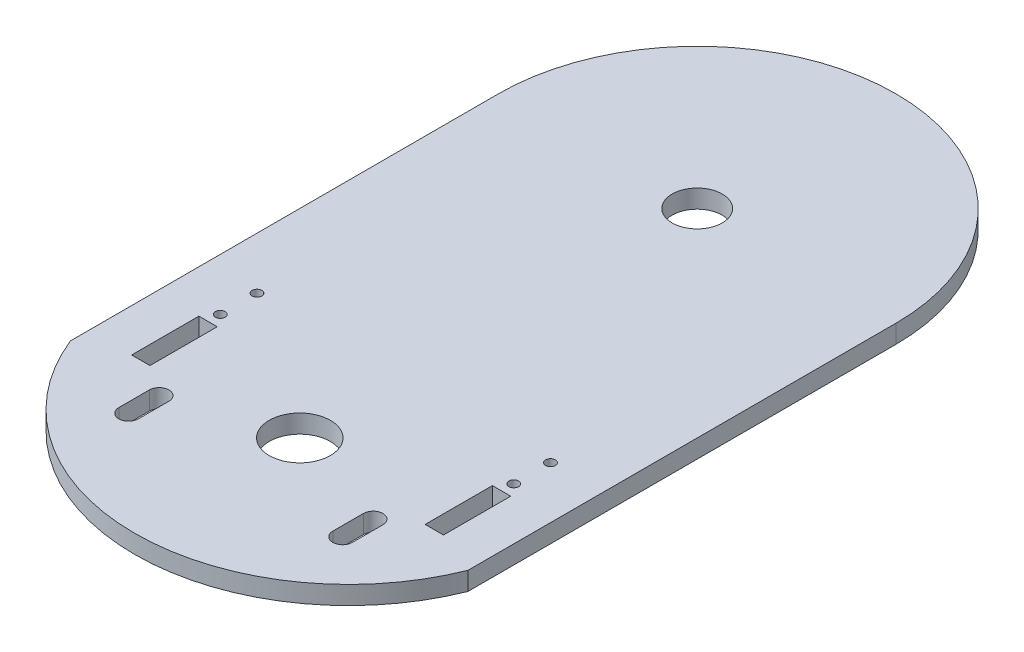
ISO-10303-21;
HEADER;
FILE_DESCRIPTION(('STEP AP214'),'2;1');
FILE_NAME('part.step','',(''),(''),'','','');
FILE_SCHEMA(('AUTOMOTIVE_DESIGN { 1 0 10303 214 1 1 1 1 }'));
ENDSEC;
DATA;
#1=APPLICATION_CONTEXT('core data for automotive mechanical design processes');
#2=APPLICATION_PROTOCOL_DEFINITION('international standard','automotive_design',2000,#1);
#3=PRODUCT_CONTEXT('',#1,'mechanical');
#4=PRODUCT('Part','Part','',(#3));
#5=PRODUCT_RELATED_PRODUCT_CATEGORY('part','',(#4));
#6=PRODUCT_DEFINITION_FORMATION('','',#4);
#7=PRODUCT_DEFINITION_CONTEXT('part definition',#1,'design');
#8=PRODUCT_DEFINITION('design','',#6,#7);
#9=PRODUCT_DEFINITION_SHAPE('','',#8);
#10=(LENGTH_UNIT() NAMED_UNIT(*) SI_UNIT(.MILLI.,.METRE.));
#11=(NAMED_UNIT(*) PLANE_ANGLE_UNIT() SI_UNIT($,.RADIAN.));
#12=(NAMED_UNIT(*) SI_UNIT($,.STERADIAN.) SOLID_ANGLE_UNIT());
#13=UNCERTAINTY_MEASURE_WITH_UNIT(LENGTH_MEASURE(1.E-05),#10,'distance_accuracy_value','');
#14=(GEOMETRIC_REPRESENTATION_CONTEXT(3) GLOBAL_UNCERTAINTY_ASSIGNED_CONTEXT((#13)) GLOBAL_UNIT_ASSIGNED_CONTEXT((#10,
#11,#12)) REPRESENTATION_CONTEXT('',''));
#15=CARTESIAN_POINT('',(0.,0.,0.));
#16=DIRECTION('',(0.,0.,1.));
#17=DIRECTION('',(1.,0.,0.));
#18=AXIS2_PLACEMENT_3D('',#15,#16,#17);
#19=CARTESIAN_POINT('',(-32.5,3.,0.));
#20=DIRECTION('',(-1.,0.,0.));
#21=DIRECTION('',(0.,0.,1.));
#22=AXIS2_PLACEMENT_3D('',#19,#20,#21);
#23=PLANE('',#22);
#24=DIRECTION('',(0.,0.,-1.));
#25=VECTOR('',#24,1.);
#26=CARTESIAN_POINT('',(-32.5,0.,0.));
#27=LINE('',#26,#25);
#28=CARTESIAN_POINT('',(-32.5,0.,35.));
#29=VERTEX_POINT('',#28);
#30=CARTESIAN_POINT('',(-32.5,0.,-35.));
#31=VERTEX_POINT('',#30);
#32=EDGE_CURVE('E340',#29,#31,#27,.T.);
#33=ORIENTED_EDGE('',*,*,#32,.F.);
#34=DIRECTION('',(0.,-1.,0.));
#35=VECTOR('',#34,1.);
#36=CARTESIAN_POINT('',(-32.5,3.,35.));
#37=LINE('',#36,#35);
#38=CARTESIAN_POINT('',(-32.5,3.,35.));
#39=VERTEX_POINT('',#38);
#40=EDGE_CURVE('E11',#39,#29,#37,.T.);
#41=ORIENTED_EDGE('',*,*,#40,.F.);
#42=DIRECTION('',(0.,0.,-1.));
#43=VECTOR('',#42,1.);
#44=CARTESIAN_POINT('',(-32.5,3.,0.));
#45=LINE('',#44,#43);
#46=CARTESIAN_POINT('',(-32.5,3.,-35.));
#47=VERTEX_POINT('',#46);
#48=EDGE_CURVE('E343',#39,#47,#45,.T.);
#49=ORIENTED_EDGE('',*,*,#48,.T.);
#50=DIRECTION('',(0.,-1.,0.));
#51=VECTOR('',#50,1.);
#52=CARTESIAN_POINT('',(-32.5,3.,-35.));
#53=LINE('',#52,#51);
#54=EDGE_CURVE('E355',#47,#31,#53,.T.);
#55=ORIENTED_EDGE('',*,*,#54,.T.);
#56=EDGE_LOOP('',(#33,#41,#49,#55));
#57=FACE_BOUND('',#56,.T.);
#58=ADVANCED_FACE('F35',(#57),#23,.T.);
#59=CARTESIAN_POINT('',(0.,3.,22.0096189432334));
#60=DIRECTION('',(0.,-1.,0.));
#61=DIRECTION('',(0.,0.,-1.));
#62=AXIS2_PLACEMENT_3D('',#59,#60,#61);
#63=CYLINDRICAL_SURFACE('',#62,35.);
#64=CARTESIAN_POINT('',(0.,0.,22.0096189432334));
#65=DIRECTION('',(0.,1.,0.));
#66=DIRECTION('',(0.,0.,1.));
#67=AXIS2_PLACEMENT_3D('',#64,#65,#66);
#68=CIRCLE('',#67,35.);
#69=CARTESIAN_POINT('',(32.5,0.,35.));
#70=VERTEX_POINT('',#69);
#71=EDGE_CURVE('E358',#70,#29,#68,.F.);
#72=ORIENTED_EDGE('',*,*,#71,.F.);
#73=DIRECTION('',(0.,-1.,0.));
#74=VECTOR('',#73,1.);
#75=CARTESIAN_POINT('',(32.5,3.,35.));
#76=LINE('',#75,#74);
#77=CARTESIAN_POINT('',(32.5,3.,35.));
#78=VERTEX_POINT('',#77);
#79=EDGE_CURVE('E42',#78,#70,#76,.T.);
#80=ORIENTED_EDGE('',*,*,#79,.F.);
#81=CARTESIAN_POINT('',(0.,3.,22.0096189432334));
#82=DIRECTION('',(0.,1.,0.));
#83=DIRECTION('',(0.,0.,1.));
#84=AXIS2_PLACEMENT_3D('',#81,#82,#83);
#85=CIRCLE('',#84,35.);
#86=EDGE_CURVE('E346',#78,#39,#85,.F.);
#87=ORIENTED_EDGE('',*,*,#86,.T.);
#88=ORIENTED_EDGE('',*,*,#40,.T.);
#89=EDGE_LOOP('',(#72,#80,#87,#88));
#90=FACE_BOUND('',#89,.T.);
#91=ADVANCED_FACE('F378',(#90),#63,.T.);
#92=CARTESIAN_POINT('',(32.5,3.,0.));
#93=DIRECTION('',(-1.,0.,0.));
#94=DIRECTION('',(0.,0.,1.));
#95=AXIS2_PLACEMENT_3D('',#92,#93,#94);
#96=PLANE('',#95);
#97=DIRECTION('',(0.,0.,-1.));
#98=VECTOR('',#97,1.);
#99=CARTESIAN_POINT('',(32.5,0.,0.));
#100=LINE('',#99,#98);
#101=CARTESIAN_POINT('',(32.5,0.,-35.));
#102=VERTEX_POINT('',#101);
#103=EDGE_CURVE('E361',#70,#102,#100,.T.);
#104=ORIENTED_EDGE('',*,*,#103,.T.);
#105=DIRECTION('',(0.,-1.,0.));
#106=VECTOR('',#105,1.);
#107=CARTESIAN_POINT('',(32.5,3.,-35.));
#108=LINE('',#107,#106);
#109=CARTESIAN_POINT('',(32.5,3.,-35.));
#110=VERTEX_POINT('',#109);
#111=EDGE_CURVE('E367',#110,#102,#108,.T.);
#112=ORIENTED_EDGE('',*,*,#111,.F.);
#113=DIRECTION('',(0.,0.,-1.));
#114=VECTOR('',#113,1.);
#115=CARTESIAN_POINT('',(32.5,3.,0.));
#116=LINE('',#115,#114);
#117=EDGE_CURVE('E350',#78,#110,#116,.T.);
#118=ORIENTED_EDGE('',*,*,#117,.F.);
#119=ORIENTED_EDGE('',*,*,#79,.T.);
#120=EDGE_LOOP('',(#104,#112,#118,#119));
#121=FACE_BOUND('',#120,.T.);
#122=ADVANCED_FACE('F371',(#121),#96,.F.);
#123=CARTESIAN_POINT('',(0.,3.,-35.));
#124=DIRECTION('',(0.,-1.,0.));
#125=DIRECTION('',(0.,0.,-1.));
#126=AXIS2_PLACEMENT_3D('',#123,#124,#125);
#127=CYLINDRICAL_SURFACE('',#126,32.5);
#128=CARTESIAN_POINT('',(0.,0.,-35.));
#129=DIRECTION('',(0.,1.,0.));
#130=DIRECTION('',(0.,0.,1.));
#131=AXIS2_PLACEMENT_3D('',#128,#129,#130);
#132=CIRCLE('',#131,32.5);
#133=EDGE_CURVE('E347',#31,#102,#132,.F.);
#134=ORIENTED_EDGE('',*,*,#133,.F.);
#135=ORIENTED_EDGE('',*,*,#54,.F.);
#136=CARTESIAN_POINT('',(0.,3.,-35.));
#137=DIRECTION('',(0.,1.,0.));
#138=DIRECTION('',(0.,0.,1.));
#139=AXIS2_PLACEMENT_3D('',#136,#137,#138);
#140=CIRCLE('',#139,32.5);
#141=EDGE_CURVE('E352',#47,#110,#140,.F.);
#142=ORIENTED_EDGE('',*,*,#141,.T.);
#143=ORIENTED_EDGE('',*,*,#111,.T.);
#144=EDGE_LOOP('',(#134,#135,#142,#143));
#145=FACE_BOUND('',#144,.T.);
#146=ADVANCED_FACE('F383',(#145),#127,.T.);
#147=CARTESIAN_POINT('',(0.,3.,0.));
#148=DIRECTION('',(0.,1.,0.));
#149=DIRECTION('',(0.,0.,1.));
#150=AXIS2_PLACEMENT_3D('',#147,#148,#149);
#151=PLANE('',#150);
#152=CARTESIAN_POINT('',(17.5,3.,35.5));
#153=DIRECTION('',(0.,1.,0.));
#154=DIRECTION('',(0.,0.,-1.));
#155=AXIS2_PLACEMENT_3D('',#152,#153,#154);
#156=CIRCLE('',#155,1.6);
#157=CARTESIAN_POINT('',(19.1,3.,35.5));
#158=VERTEX_POINT('',#157);
#159=CARTESIAN_POINT('',(15.9,3.,35.5));
#160=VERTEX_POINT('',#159);
#161=EDGE_CURVE('E190',#158,#160,#156,.T.);
#162=ORIENTED_EDGE('',*,*,#161,.F.);
#163=DIRECTION('',(0.,0.,-1.));
#164=VECTOR('',#163,1.);
#165=CARTESIAN_POINT('',(19.1,3.,35.5));
#166=LINE('',#165,#164);
#167=CARTESIAN_POINT('',(19.1,3.,40.5));
#168=VERTEX_POINT('',#167);
#169=EDGE_CURVE('E195',#168,#158,#166,.T.);
#170=ORIENTED_EDGE('',*,*,#169,.F.);
#171=CARTESIAN_POINT('',(17.5,3.,40.5));
#172=DIRECTION('',(0.,1.,0.));
#173=DIRECTION('',(0.,0.,-1.));
#174=AXIS2_PLACEMENT_3D('',#171,#172,#173);
#175=CIRCLE('',#174,1.6);
#176=CARTESIAN_POINT('',(15.9,3.,40.5));
#177=VERTEX_POINT('',#176);
#178=EDGE_CURVE('E197',#177,#168,#175,.T.);
#179=ORIENTED_EDGE('',*,*,#178,.F.);
#180=DIRECTION('',(0.,0.,1.));
#181=VECTOR('',#180,1.);
#182=CARTESIAN_POINT('',(15.9,3.,35.5));
#183=LINE('',#182,#181);
#184=EDGE_CURVE('E203',#160,#177,#183,.T.);
#185=ORIENTED_EDGE('',*,*,#184,.F.);
#186=EDGE_LOOP('',(#162,#170,#179,#185));
#187=FACE_BOUND('',#186,.T.);
#188=DIRECTION('',(0.,0.,-1.));
#189=VECTOR('',#188,1.);
#190=CARTESIAN_POINT('',(-15.9,3.,35.5));
#191=LINE('',#190,#189);
#192=CARTESIAN_POINT('',(-15.9,3.,40.5));
#193=VERTEX_POINT('',#192);
#194=CARTESIAN_POINT('',(-15.9,3.,35.5));
#195=VERTEX_POINT('',#194);
#196=EDGE_CURVE('E217',#193,#195,#191,.T.);
#197=ORIENTED_EDGE('',*,*,#196,.F.);
#198=CARTESIAN_POINT('',(-17.5,3.,40.5));
#199=DIRECTION('',(0.,1.,0.));
#200=DIRECTION('',(0.,0.,1.));
#201=AXIS2_PLACEMENT_3D('',#198,#199,#200);
#202=CIRCLE('',#201,1.6);
#203=CARTESIAN_POINT('',(-19.1,3.,40.5));
#204=VERTEX_POINT('',#203);
#205=EDGE_CURVE('E229',#204,#193,#202,.T.);
#206=ORIENTED_EDGE('',*,*,#205,.F.);
#207=DIRECTION('',(0.,0.,1.));
#208=VECTOR('',#207,1.);
#209=CARTESIAN_POINT('',(-19.1,3.,35.5));
#210=LINE('',#209,#208);
#211=CARTESIAN_POINT('',(-19.1,3.,35.5));
#212=VERTEX_POINT('',#211);
#213=EDGE_CURVE('E227',#212,#204,#210,.T.);
#214=ORIENTED_EDGE('',*,*,#213,.F.);
#215=CARTESIAN_POINT('',(-17.5,3.,35.5));
#216=DIRECTION('',(0.,1.,0.));
#217=DIRECTION('',(0.,0.,1.));
#218=AXIS2_PLACEMENT_3D('',#215,#216,#217);
#219=CIRCLE('',#218,1.6);
#220=EDGE_CURVE('E209',#195,#212,#219,.T.);
#221=ORIENTED_EDGE('',*,*,#220,.F.);
#222=EDGE_LOOP('',(#197,#206,#214,#221));
#223=FACE_BOUND('',#222,.T.);
#224=CARTESIAN_POINT('',(24.,3.,13.));
#225=DIRECTION('',(0.,1.,0.));
#226=DIRECTION('',(0.,0.,-1.));
#227=AXIS2_PLACEMENT_3D('',#224,#225,#226);
#228=CIRCLE('',#227,0.799999999999999);
#229=CARTESIAN_POINT('',(24.,3.,12.2));
#230=VERTEX_POINT('',#229);
#231=EDGE_CURVE('E236',#230,#230,#228,.T.);
#232=ORIENTED_EDGE('',*,*,#231,.F.);
#233=EDGE_LOOP('',(#232));
#234=FACE_BOUND('',#233,.T.);
#235=CARTESIAN_POINT('',(24.,3.,19.));
#236=DIRECTION('',(0.,1.,0.));
#237=DIRECTION('',(0.,0.,-1.));
#238=AXIS2_PLACEMENT_3D('',#235,#236,#237);
#239=CIRCLE('',#238,0.799999999999999);
#240=CARTESIAN_POINT('',(24.,3.,18.2));
#241=VERTEX_POINT('',#240);
#242=EDGE_CURVE('E253',#241,#241,#239,.T.);
#243=ORIENTED_EDGE('',*,*,#242,.F.);
#244=EDGE_LOOP('',(#243));
#245=FACE_BOUND('',#244,.T.);
#246=CARTESIAN_POINT('',(-24.,3.,19.));
#247=DIRECTION('',(0.,1.,0.));
#248=DIRECTION('',(0.,0.,1.));
#249=AXIS2_PLACEMENT_3D('',#246,#247,#248);
#250=CIRCLE('',#249,0.799999999999999);
#251=CARTESIAN_POINT('',(-24.,3.,19.8));
#252=VERTEX_POINT('',#251);
#253=EDGE_CURVE('E247',#252,#252,#250,.T.);
#254=ORIENTED_EDGE('',*,*,#253,.F.);
#255=EDGE_LOOP('',(#254));
#256=FACE_BOUND('',#255,.T.);
#257=CARTESIAN_POINT('',(-24.,3.,13.));
#258=DIRECTION('',(0.,1.,0.));
#259=DIRECTION('',(0.,0.,1.));
#260=AXIS2_PLACEMENT_3D('',#257,#258,#259);
#261=CIRCLE('',#260,0.799999999999999);
#262=CARTESIAN_POINT('',(-24.,3.,13.8));
#263=VERTEX_POINT('',#262);
#264=EDGE_CURVE('E246',#263,#263,#261,.T.);
#265=ORIENTED_EDGE('',*,*,#264,.F.);
#266=EDGE_LOOP('',(#265));
#267=FACE_BOUND('',#266,.T.);
#268=DIRECTION('',(0.,0.,-1.));
#269=VECTOR('',#268,1.);
#270=CARTESIAN_POINT('',(25.5,3.,21.));
#271=LINE('',#270,#269);
#272=CARTESIAN_POINT('',(25.5,3.,32.));
#273=VERTEX_POINT('',#272);
#274=CARTESIAN_POINT('',(25.5,3.,21.));
#275=VERTEX_POINT('',#274);
#276=EDGE_CURVE('E275',#273,#275,#271,.T.);
#277=ORIENTED_EDGE('',*,*,#276,.F.);
#278=DIRECTION('',(1.,0.,0.));
#279=VECTOR('',#278,1.);
#280=CARTESIAN_POINT('',(25.5,3.,32.));
#281=LINE('',#280,#279);
#282=CARTESIAN_POINT('',(22.5,3.,32.));
#283=VERTEX_POINT('',#282);
#284=EDGE_CURVE('E265',#283,#273,#281,.T.);
#285=ORIENTED_EDGE('',*,*,#284,.F.);
#286=DIRECTION('',(0.,0.,1.));
#287=VECTOR('',#286,1.);
#288=CARTESIAN_POINT('',(22.5,3.,21.));
#289=LINE('',#288,#287);
#290=CARTESIAN_POINT('',(22.5,3.,21.));
#291=VERTEX_POINT('',#290);
#292=EDGE_CURVE('E281',#291,#283,#289,.T.);
#293=ORIENTED_EDGE('',*,*,#292,.F.);
#294=DIRECTION('',(-1.,0.,0.));
#295=VECTOR('',#294,1.);
#296=CARTESIAN_POINT('',(25.5,3.,21.));
#297=LINE('',#296,#295);
#298=EDGE_CURVE('E277',#275,#291,#297,.T.);
#299=ORIENTED_EDGE('',*,*,#298,.F.);
#300=EDGE_LOOP('',(#277,#285,#293,#299));
#301=FACE_BOUND('',#300,.T.);
#302=DIRECTION('',(0.,0.,1.));
#303=VECTOR('',#302,1.);
#304=CARTESIAN_POINT('',(-25.5,3.,21.));
#305=LINE('',#304,#303);
#306=CARTESIAN_POINT('',(-25.5,3.,21.));
#307=VERTEX_POINT('',#306);
#308=CARTESIAN_POINT('',(-25.5,3.,32.));
#309=VERTEX_POINT('',#308);
#310=EDGE_CURVE('E288',#307,#309,#305,.T.);
#311=ORIENTED_EDGE('',*,*,#310,.F.);
#312=DIRECTION('',(-1.,0.,0.));
#313=VECTOR('',#312,1.);
#314=CARTESIAN_POINT('',(-25.5,3.,21.));
#315=LINE('',#314,#313);
#316=CARTESIAN_POINT('',(-22.5,3.,21.));
#317=VERTEX_POINT('',#316);
#318=EDGE_CURVE('E303',#317,#307,#315,.T.);
#319=ORIENTED_EDGE('',*,*,#318,.F.);
#320=DIRECTION('',(0.,0.,-1.));
#321=VECTOR('',#320,1.);
#322=CARTESIAN_POINT('',(-22.5,3.,21.));
#323=LINE('',#322,#321);
#324=CARTESIAN_POINT('',(-22.5,3.,32.));
#325=VERTEX_POINT('',#324);
#326=EDGE_CURVE('E317',#325,#317,#323,.T.);
#327=ORIENTED_EDGE('',*,*,#326,.F.);
#328=DIRECTION('',(1.,0.,0.));
#329=VECTOR('',#328,1.);
#330=CARTESIAN_POINT('',(-25.5,3.,32.));
#331=LINE('',#330,#329);
#332=EDGE_CURVE('E314',#309,#325,#331,.T.);
#333=ORIENTED_EDGE('',*,*,#332,.F.);
#334=EDGE_LOOP('',(#311,#319,#327,#333));
#335=FACE_BOUND('',#334,.T.);
#336=CARTESIAN_POINT('',(0.,3.,30.));
#337=DIRECTION('',(0.,1.,0.));
#338=DIRECTION('',(0.,0.,1.));
#339=AXIS2_PLACEMENT_3D('',#336,#337,#338);
#340=CIRCLE('',#339,5.);
#341=CARTESIAN_POINT('',(0.,3.,35.));
#342=VERTEX_POINT('',#341);
#343=EDGE_CURVE('E324',#342,#342,#340,.T.);
#344=ORIENTED_EDGE('',*,*,#343,.F.);
#345=EDGE_LOOP('',(#344));
#346=FACE_BOUND('',#345,.T.);
#347=CARTESIAN_POINT('',(0.,3.,-35.));
#348=DIRECTION('',(0.,1.,0.));
#349=DIRECTION('',(0.,0.,1.));
#350=AXIS2_PLACEMENT_3D('',#347,#348,#349);
#351=CIRCLE('',#350,4.1);
#352=CARTESIAN_POINT('',(0.,3.,-30.9));
#353=VERTEX_POINT('',#352);
#354=EDGE_CURVE('E334',#353,#353,#351,.T.);
#355=ORIENTED_EDGE('',*,*,#354,.F.);
#356=EDGE_LOOP('',(#355));
#357=FACE_BOUND('',#356,.T.);
#358=ORIENTED_EDGE('',*,*,#48,.F.);
#359=ORIENTED_EDGE('',*,*,#86,.F.);
#360=ORIENTED_EDGE('',*,*,#117,.T.);
#361=ORIENTED_EDGE('',*,*,#141,.F.);
#362=EDGE_LOOP('',(#358,#359,#360,#361));
#363=FACE_BOUND('',#362,.T.);
#364=ADVANCED_FACE('F386',(#187,#223,#234,#245,#256,#267,#301,#335,#346,#357,#363),#151,.T.);
#365=CARTESIAN_POINT('',(0.,0.,0.));
#366=DIRECTION('',(0.,1.,0.));
#367=DIRECTION('',(0.,0.,1.));
#368=AXIS2_PLACEMENT_3D('',#365,#366,#367);
#369=PLANE('',#368);
#370=CARTESIAN_POINT('',(24.,0.,13.));
#371=DIRECTION('',(0.,1.,0.));
#372=DIRECTION('',(0.,0.,-1.));
#373=AXIS2_PLACEMENT_3D('',#370,#371,#372);
#374=CIRCLE('',#373,0.799999999999999);
#375=CARTESIAN_POINT('',(24.,0.,12.2));
#376=VERTEX_POINT('',#375);
#377=EDGE_CURVE('E256',#376,#376,#374,.T.);
#378=ORIENTED_EDGE('',*,*,#377,.T.);
#379=EDGE_LOOP('',(#378));
#380=FACE_BOUND('',#379,.T.);
#381=CARTESIAN_POINT('',(24.,0.,19.));
#382=DIRECTION('',(0.,1.,0.));
#383=DIRECTION('',(0.,0.,-1.));
#384=AXIS2_PLACEMENT_3D('',#381,#382,#383);
#385=CIRCLE('',#384,0.799999999999999);
#386=CARTESIAN_POINT('',(24.,0.,18.2));
#387=VERTEX_POINT('',#386);
#388=EDGE_CURVE('E250',#387,#387,#385,.T.);
#389=ORIENTED_EDGE('',*,*,#388,.T.);
#390=EDGE_LOOP('',(#389));
#391=FACE_BOUND('',#390,.T.);
#392=CARTESIAN_POINT('',(-24.,0.,19.));
#393=DIRECTION('',(0.,1.,0.));
#394=DIRECTION('',(0.,0.,1.));
#395=AXIS2_PLACEMENT_3D('',#392,#393,#394);
#396=CIRCLE('',#395,0.799999999999999);
#397=CARTESIAN_POINT('',(-24.,0.,19.8));
#398=VERTEX_POINT('',#397);
#399=EDGE_CURVE('E243',#398,#398,#396,.T.);
#400=ORIENTED_EDGE('',*,*,#399,.T.);
#401=EDGE_LOOP('',(#400));
#402=FACE_BOUND('',#401,.T.);
#403=CARTESIAN_POINT('',(-24.,0.,13.));
#404=DIRECTION('',(0.,1.,0.));
#405=DIRECTION('',(0.,0.,1.));
#406=AXIS2_PLACEMENT_3D('',#403,#404,#405);
#407=CIRCLE('',#406,0.799999999999999);
#408=CARTESIAN_POINT('',(-24.,0.,13.8));
#409=VERTEX_POINT('',#408);
#410=EDGE_CURVE('E278',#409,#409,#407,.T.);
#411=ORIENTED_EDGE('',*,*,#410,.T.);
#412=EDGE_LOOP('',(#411));
#413=FACE_BOUND('',#412,.T.);
#414=DIRECTION('',(1.,0.,0.));
#415=VECTOR('',#414,1.);
#416=CARTESIAN_POINT('',(25.5,0.,32.));
#417=LINE('',#416,#415);
#418=CARTESIAN_POINT('',(22.5,0.,32.));
#419=VERTEX_POINT('',#418);
#420=CARTESIAN_POINT('',(25.5,0.,32.));
#421=VERTEX_POINT('',#420);
#422=EDGE_CURVE('E271',#419,#421,#417,.T.);
#423=ORIENTED_EDGE('',*,*,#422,.T.);
#424=DIRECTION('',(0.,0.,-1.));
#425=VECTOR('',#424,1.);
#426=CARTESIAN_POINT('',(25.5,0.,21.));
#427=LINE('',#426,#425);
#428=CARTESIAN_POINT('',(25.5,0.,21.));
#429=VERTEX_POINT('',#428);
#430=EDGE_CURVE('E261',#421,#429,#427,.T.);
#431=ORIENTED_EDGE('',*,*,#430,.T.);
#432=DIRECTION('',(-1.,0.,0.));
#433=VECTOR('',#432,1.);
#434=CARTESIAN_POINT('',(25.5,0.,21.));
#435=LINE('',#434,#433);
#436=CARTESIAN_POINT('',(22.5,0.,21.));
#437=VERTEX_POINT('',#436);
#438=EDGE_CURVE('E264',#429,#437,#435,.T.);
#439=ORIENTED_EDGE('',*,*,#438,.T.);
#440=DIRECTION('',(0.,0.,1.));
#441=VECTOR('',#440,1.);
#442=CARTESIAN_POINT('',(22.5,0.,21.));
#443=LINE('',#442,#441);
#444=EDGE_CURVE('E268',#437,#419,#443,.T.);
#445=ORIENTED_EDGE('',*,*,#444,.T.);
#446=EDGE_LOOP('',(#423,#431,#439,#445));
#447=FACE_BOUND('',#446,.T.);
#448=DIRECTION('',(-1.,0.,0.));
#449=VECTOR('',#448,1.);
#450=CARTESIAN_POINT('',(-25.5,0.,21.));
#451=LINE('',#450,#449);
#452=CARTESIAN_POINT('',(-22.5,0.,21.));
#453=VERTEX_POINT('',#452);
#454=CARTESIAN_POINT('',(-25.5,0.,21.));
#455=VERTEX_POINT('',#454);
#456=EDGE_CURVE('E309',#453,#455,#451,.T.);
#457=ORIENTED_EDGE('',*,*,#456,.T.);
#458=DIRECTION('',(0.,0.,1.));
#459=VECTOR('',#458,1.);
#460=CARTESIAN_POINT('',(-25.5,0.,21.));
#461=LINE('',#460,#459);
#462=CARTESIAN_POINT('',(-25.5,0.,32.));
#463=VERTEX_POINT('',#462);
#464=EDGE_CURVE('E299',#455,#463,#461,.T.);
#465=ORIENTED_EDGE('',*,*,#464,.T.);
#466=DIRECTION('',(1.,0.,0.));
#467=VECTOR('',#466,1.);
#468=CARTESIAN_POINT('',(-25.5,0.,32.));
#469=LINE('',#468,#467);
#470=CARTESIAN_POINT('',(-22.5,0.,32.));
#471=VERTEX_POINT('',#470);
#472=EDGE_CURVE('E302',#463,#471,#469,.T.);
#473=ORIENTED_EDGE('',*,*,#472,.T.);
#474=DIRECTION('',(0.,0.,-1.));
#475=VECTOR('',#474,1.);
#476=CARTESIAN_POINT('',(-22.5,0.,21.));
#477=LINE('',#476,#475);
#478=EDGE_CURVE('E306',#471,#453,#477,.T.);
#479=ORIENTED_EDGE('',*,*,#478,.T.);
#480=EDGE_LOOP('',(#457,#465,#473,#479));
#481=FACE_BOUND('',#480,.T.);
#482=CARTESIAN_POINT('',(0.,0.,30.));
#483=DIRECTION('',(0.,1.,0.));
#484=DIRECTION('',(0.,0.,1.));
#485=AXIS2_PLACEMENT_3D('',#482,#483,#484);
#486=CIRCLE('',#485,5.);
#487=CARTESIAN_POINT('',(0.,0.,35.));
#488=VERTEX_POINT('',#487);
#489=EDGE_CURVE('E331',#488,#488,#486,.T.);
#490=ORIENTED_EDGE('',*,*,#489,.T.);
#491=EDGE_LOOP('',(#490));
#492=FACE_BOUND('',#491,.T.);
#493=CARTESIAN_POINT('',(-17.5,0.,40.5));
#494=DIRECTION('',(0.,1.,0.));
#495=DIRECTION('',(0.,0.,1.));
#496=AXIS2_PLACEMENT_3D('',#493,#494,#495);
#497=CIRCLE('',#496,1.6);
#498=CARTESIAN_POINT('',(-19.1,0.,40.5));
#499=VERTEX_POINT('',#498);
#500=CARTESIAN_POINT('',(-15.9,0.,40.5));
#501=VERTEX_POINT('',#500);
#502=EDGE_CURVE('E57',#499,#501,#497,.T.);
#503=ORIENTED_EDGE('',*,*,#502,.T.);
#504=DIRECTION('',(0.,0.,-1.));
#505=VECTOR('',#504,1.);
#506=CARTESIAN_POINT('',(-15.9,0.,35.5));
#507=LINE('',#506,#505);
#508=CARTESIAN_POINT('',(-15.9,0.,35.5));
#509=VERTEX_POINT('',#508);
#510=EDGE_CURVE('E221',#501,#509,#507,.T.);
#511=ORIENTED_EDGE('',*,*,#510,.T.);
#512=CARTESIAN_POINT('',(-17.5,0.,35.5));
#513=DIRECTION('',(0.,1.,0.));
#514=DIRECTION('',(0.,0.,1.));
#515=AXIS2_PLACEMENT_3D('',#512,#513,#514);
#516=CIRCLE('',#515,1.6);
#517=CARTESIAN_POINT('',(-19.1,0.,35.5));
#518=VERTEX_POINT('',#517);
#519=EDGE_CURVE('E213',#509,#518,#516,.T.);
#520=ORIENTED_EDGE('',*,*,#519,.T.);
#521=DIRECTION('',(0.,0.,1.));
#522=VECTOR('',#521,1.);
#523=CARTESIAN_POINT('',(-19.1,0.,35.5));
#524=LINE('',#523,#522);
#525=EDGE_CURVE('E216',#518,#499,#524,.T.);
#526=ORIENTED_EDGE('',*,*,#525,.T.);
#527=EDGE_LOOP('',(#503,#511,#520,#526));
#528=FACE_BOUND('',#527,.T.);
#529=CARTESIAN_POINT('',(17.5,0.,40.5));
#530=DIRECTION('',(0.,1.,0.));
#531=DIRECTION('',(0.,0.,-1.));
#532=AXIS2_PLACEMENT_3D('',#529,#530,#531);
#533=CIRCLE('',#532,1.6);
#534=CARTESIAN_POINT('',(15.9,0.,40.5));
#535=VERTEX_POINT('',#534);
#536=CARTESIAN_POINT('',(19.1,0.,40.5));
#537=VERTEX_POINT('',#536);
#538=EDGE_CURVE('E49',#535,#537,#533,.T.);
#539=ORIENTED_EDGE('',*,*,#538,.T.);
#540=DIRECTION('',(0.,0.,-1.));
#541=VECTOR('',#540,1.);
#542=CARTESIAN_POINT('',(19.1,0.,35.5));
#543=LINE('',#542,#541);
#544=CARTESIAN_POINT('',(19.1,0.,35.5));
#545=VERTEX_POINT('',#544);
#546=EDGE_CURVE('E191',#537,#545,#543,.T.);
#547=ORIENTED_EDGE('',*,*,#546,.T.);
#548=CARTESIAN_POINT('',(17.5,0.,35.5));
#549=DIRECTION('',(0.,1.,0.));
#550=DIRECTION('',(0.,0.,-1.));
#551=AXIS2_PLACEMENT_3D('',#548,#549,#550);
#552=CIRCLE('',#551,1.6);
#553=CARTESIAN_POINT('',(15.9,0.,35.5));
#554=VERTEX_POINT('',#553);
#555=EDGE_CURVE('E182',#545,#554,#552,.T.);
#556=ORIENTED_EDGE('',*,*,#555,.T.);
#557=DIRECTION('',(0.,0.,1.));
#558=VECTOR('',#557,1.);
#559=CARTESIAN_POINT('',(15.9,0.,35.5));
#560=LINE('',#559,#558);
#561=EDGE_CURVE('E174',#554,#535,#560,.T.);
#562=ORIENTED_EDGE('',*,*,#561,.T.);
#563=EDGE_LOOP('',(#539,#547,#556,#562));
#564=FACE_BOUND('',#563,.T.);
#565=CARTESIAN_POINT('',(0.,0.,-35.));
#566=DIRECTION('',(0.,1.,0.));
#567=DIRECTION('',(0.,0.,1.));
#568=AXIS2_PLACEMENT_3D('',#565,#566,#567);
#569=CIRCLE('',#568,4.1);
#570=CARTESIAN_POINT('',(0.,0.,-30.9));
#571=VERTEX_POINT('',#570);
#572=EDGE_CURVE('E337',#571,#571,#569,.T.);
#573=ORIENTED_EDGE('',*,*,#572,.T.);
#574=EDGE_LOOP('',(#573));
#575=FACE_BOUND('',#574,.T.);
#576=ORIENTED_EDGE('',*,*,#32,.T.);
#577=ORIENTED_EDGE('',*,*,#133,.T.);
#578=ORIENTED_EDGE('',*,*,#103,.F.);
#579=ORIENTED_EDGE('',*,*,#71,.T.);
#580=EDGE_LOOP('',(#576,#577,#578,#579));
#581=FACE_BOUND('',#580,.T.);
#582=ADVANCED_FACE('F193',(#380,#391,#402,#413,#447,#481,#492,#528,#564,#575,#581),#369,.F.);
#583=CARTESIAN_POINT('',(0.,0.,-35.));
#584=DIRECTION('',(0.,1.,0.));
#585=DIRECTION('',(0.,0.,1.));
#586=AXIS2_PLACEMENT_3D('',#583,#584,#585);
#587=CYLINDRICAL_SURFACE('',#586,4.1);
#588=ORIENTED_EDGE('',*,*,#572,.F.);
#589=EDGE_LOOP('',(#588));
#590=FACE_BOUND('',#589,.T.);
#591=ORIENTED_EDGE('',*,*,#354,.T.);
#592=EDGE_LOOP('',(#591));
#593=FACE_BOUND('',#592,.T.);
#594=ADVANCED_FACE('F394',(#590,#593),#587,.F.);
#595=CARTESIAN_POINT('',(0.,0.,30.));
#596=DIRECTION('',(0.,1.,0.));
#597=DIRECTION('',(0.,0.,1.));
#598=AXIS2_PLACEMENT_3D('',#595,#596,#597);
#599=CYLINDRICAL_SURFACE('',#598,5.);
#600=ORIENTED_EDGE('',*,*,#489,.F.);
#601=EDGE_LOOP('',(#600));
#602=FACE_BOUND('',#601,.T.);
#603=ORIENTED_EDGE('',*,*,#343,.T.);
#604=EDGE_LOOP('',(#603));
#605=FACE_BOUND('',#604,.T.);
#606=ADVANCED_FACE('F436',(#602,#605),#599,.F.);
#607=CARTESIAN_POINT('',(-25.5,0.,21.));
#608=DIRECTION('',(-1.,0.,0.));
#609=DIRECTION('',(0.,0.,1.));
#610=AXIS2_PLACEMENT_3D('',#607,#608,#609);
#611=PLANE('',#610);
#612=ORIENTED_EDGE('',*,*,#310,.T.);
#613=DIRECTION('',(0.,1.,0.));
#614=VECTOR('',#613,1.);
#615=CARTESIAN_POINT('',(-25.5,0.,32.));
#616=LINE('',#615,#614);
#617=EDGE_CURVE('E312',#463,#309,#616,.T.);
#618=ORIENTED_EDGE('',*,*,#617,.F.);
#619=ORIENTED_EDGE('',*,*,#464,.F.);
#620=DIRECTION('',(0.,1.,0.));
#621=VECTOR('',#620,1.);
#622=CARTESIAN_POINT('',(-25.5,0.,21.));
#623=LINE('',#622,#621);
#624=EDGE_CURVE('E322',#455,#307,#623,.T.);
#625=ORIENTED_EDGE('',*,*,#624,.T.);
#626=EDGE_LOOP('',(#612,#618,#619,#625));
#627=FACE_BOUND('',#626,.T.);
#628=ADVANCED_FACE('F442',(#627),#611,.F.);
#629=CARTESIAN_POINT('',(-25.5,0.,21.));
#630=DIRECTION('',(0.,0.,-1.));
#631=DIRECTION('',(-1.,0.,0.));
#632=AXIS2_PLACEMENT_3D('',#629,#630,#631);
#633=PLANE('',#632);
#634=ORIENTED_EDGE('',*,*,#318,.T.);
#635=ORIENTED_EDGE('',*,*,#624,.F.);
#636=ORIENTED_EDGE('',*,*,#456,.F.);
#637=DIRECTION('',(0.,1.,0.));
#638=VECTOR('',#637,1.);
#639=CARTESIAN_POINT('',(-22.5,0.,21.));
#640=LINE('',#639,#638);
#641=EDGE_CURVE('E325',#453,#317,#640,.T.);
#642=ORIENTED_EDGE('',*,*,#641,.T.);
#643=EDGE_LOOP('',(#634,#635,#636,#642));
#644=FACE_BOUND('',#643,.T.);
#645=ADVANCED_FACE('F450',(#644),#633,.F.);
#646=CARTESIAN_POINT('',(-22.5,0.,21.));
#647=DIRECTION('',(1.,0.,0.));
#648=DIRECTION('',(0.,0.,-1.));
#649=AXIS2_PLACEMENT_3D('',#646,#647,#648);
#650=PLANE('',#649);
#651=ORIENTED_EDGE('',*,*,#326,.T.);
#652=ORIENTED_EDGE('',*,*,#641,.F.);
#653=ORIENTED_EDGE('',*,*,#478,.F.);
#654=DIRECTION('',(0.,1.,0.));
#655=VECTOR('',#654,1.);
#656=CARTESIAN_POINT('',(-22.5,0.,32.));
#657=LINE('',#656,#655);
#658=EDGE_CURVE('E327',#471,#325,#657,.T.);
#659=ORIENTED_EDGE('',*,*,#658,.T.);
#660=EDGE_LOOP('',(#651,#652,#653,#659));
#661=FACE_BOUND('',#660,.T.);
#662=ADVANCED_FACE('F458',(#661),#650,.F.);
#663=CARTESIAN_POINT('',(-25.5,0.,32.));
#664=DIRECTION('',(0.,0.,1.));
#665=DIRECTION('',(1.,0.,0.));
#666=AXIS2_PLACEMENT_3D('',#663,#664,#665);
#667=PLANE('',#666);
#668=ORIENTED_EDGE('',*,*,#332,.T.);
#669=ORIENTED_EDGE('',*,*,#658,.F.);
#670=ORIENTED_EDGE('',*,*,#472,.F.);
#671=ORIENTED_EDGE('',*,*,#617,.T.);
#672=EDGE_LOOP('',(#668,#669,#670,#671));
#673=FACE_BOUND('',#672,.T.);
#674=ADVANCED_FACE('F466',(#673),#667,.F.);
#675=CARTESIAN_POINT('',(25.5,0.,21.));
#676=DIRECTION('',(1.,0.,0.));
#677=DIRECTION('',(0.,0.,-1.));
#678=AXIS2_PLACEMENT_3D('',#675,#676,#677);
#679=PLANE('',#678);
#680=ORIENTED_EDGE('',*,*,#276,.T.);
#681=DIRECTION('',(0.,1.,0.));
#682=VECTOR('',#681,1.);
#683=CARTESIAN_POINT('',(25.5,0.,21.));
#684=LINE('',#683,#682);
#685=EDGE_CURVE('E274',#429,#275,#684,.T.);
#686=ORIENTED_EDGE('',*,*,#685,.F.);
#687=ORIENTED_EDGE('',*,*,#430,.F.);
#688=DIRECTION('',(0.,1.,0.));
#689=VECTOR('',#688,1.);
#690=CARTESIAN_POINT('',(25.5,0.,32.));
#691=LINE('',#690,#689);
#692=EDGE_CURVE('E286',#421,#273,#691,.T.);
#693=ORIENTED_EDGE('',*,*,#692,.T.);
#694=EDGE_LOOP('',(#680,#686,#687,#693));
#695=FACE_BOUND('',#694,.T.);
#696=ADVANCED_FACE('F474',(#695),#679,.F.);
#697=CARTESIAN_POINT('',(25.5,0.,32.));
#698=DIRECTION('',(0.,0.,1.));
#699=DIRECTION('',(1.,0.,0.));
#700=AXIS2_PLACEMENT_3D('',#697,#698,#699);
#701=PLANE('',#700);
#702=ORIENTED_EDGE('',*,*,#284,.T.);
#703=ORIENTED_EDGE('',*,*,#692,.F.);
#704=ORIENTED_EDGE('',*,*,#422,.F.);
#705=DIRECTION('',(0.,1.,0.));
#706=VECTOR('',#705,1.);
#707=CARTESIAN_POINT('',(22.5,0.,32.));
#708=LINE('',#707,#706);
#709=EDGE_CURVE('E289',#419,#283,#708,.T.);
#710=ORIENTED_EDGE('',*,*,#709,.T.);
#711=EDGE_LOOP('',(#702,#703,#704,#710));
#712=FACE_BOUND('',#711,.T.);
#713=ADVANCED_FACE('F482',(#712),#701,.F.);
#714=CARTESIAN_POINT('',(22.5,0.,21.));
#715=DIRECTION('',(-1.,0.,0.));
#716=DIRECTION('',(0.,0.,1.));
#717=AXIS2_PLACEMENT_3D('',#714,#715,#716);
#718=PLANE('',#717);
#719=ORIENTED_EDGE('',*,*,#292,.T.);
#720=ORIENTED_EDGE('',*,*,#709,.F.);
#721=ORIENTED_EDGE('',*,*,#444,.F.);
#722=DIRECTION('',(0.,1.,0.));
#723=VECTOR('',#722,1.);
#724=CARTESIAN_POINT('',(22.5,0.,21.));
#725=LINE('',#724,#723);
#726=EDGE_CURVE('E291',#437,#291,#725,.T.);
#727=ORIENTED_EDGE('',*,*,#726,.T.);
#728=EDGE_LOOP('',(#719,#720,#721,#727));
#729=FACE_BOUND('',#728,.T.);
#730=ADVANCED_FACE('F490',(#729),#718,.F.);
#731=CARTESIAN_POINT('',(25.5,0.,21.));
#732=DIRECTION('',(0.,0.,-1.));
#733=DIRECTION('',(-1.,0.,0.));
#734=AXIS2_PLACEMENT_3D('',#731,#732,#733);
#735=PLANE('',#734);
#736=ORIENTED_EDGE('',*,*,#298,.T.);
#737=ORIENTED_EDGE('',*,*,#726,.F.);
#738=ORIENTED_EDGE('',*,*,#438,.F.);
#739=ORIENTED_EDGE('',*,*,#685,.T.);
#740=EDGE_LOOP('',(#736,#737,#738,#739));
#741=FACE_BOUND('',#740,.T.);
#742=ADVANCED_FACE('F498',(#741),#735,.F.);
#743=CARTESIAN_POINT('',(-24.,0.,13.));
#744=DIRECTION('',(0.,1.,0.));
#745=DIRECTION('',(0.,0.,1.));
#746=AXIS2_PLACEMENT_3D('',#743,#744,#745);
#747=CYLINDRICAL_SURFACE('',#746,0.799999999999999);
#748=ORIENTED_EDGE('',*,*,#410,.F.);
#749=EDGE_LOOP('',(#748));
#750=FACE_BOUND('',#749,.T.);
#751=ORIENTED_EDGE('',*,*,#264,.T.);
#752=EDGE_LOOP('',(#751));
#753=FACE_BOUND('',#752,.T.);
#754=ADVANCED_FACE('F506',(#750,#753),#747,.F.);
#755=CARTESIAN_POINT('',(-24.,0.,19.));
#756=DIRECTION('',(0.,1.,0.));
#757=DIRECTION('',(0.,0.,1.));
#758=AXIS2_PLACEMENT_3D('',#755,#756,#757);
#759=CYLINDRICAL_SURFACE('',#758,0.799999999999999);
#760=ORIENTED_EDGE('',*,*,#399,.F.);
#761=EDGE_LOOP('',(#760));
#762=FACE_BOUND('',#761,.T.);
#763=ORIENTED_EDGE('',*,*,#253,.T.);
#764=EDGE_LOOP('',(#763));
#765=FACE_BOUND('',#764,.T.);
#766=ADVANCED_FACE('F514',(#762,#765),#759,.F.);
#767=CARTESIAN_POINT('',(24.,0.,19.));
#768=DIRECTION('',(0.,1.,0.));
#769=DIRECTION('',(0.,0.,1.));
#770=AXIS2_PLACEMENT_3D('',#767,#768,#769);
#771=CYLINDRICAL_SURFACE('',#770,0.799999999999999);
#772=ORIENTED_EDGE('',*,*,#388,.F.);
#773=EDGE_LOOP('',(#772));
#774=FACE_BOUND('',#773,.T.);
#775=ORIENTED_EDGE('',*,*,#242,.T.);
#776=EDGE_LOOP('',(#775));
#777=FACE_BOUND('',#776,.T.);
#778=ADVANCED_FACE('F522',(#774,#777),#771,.F.);
#779=CARTESIAN_POINT('',(24.,0.,13.));
#780=DIRECTION('',(0.,1.,0.));
#781=DIRECTION('',(0.,0.,1.));
#782=AXIS2_PLACEMENT_3D('',#779,#780,#781);
#783=CYLINDRICAL_SURFACE('',#782,0.799999999999999);
#784=ORIENTED_EDGE('',*,*,#377,.F.);
#785=EDGE_LOOP('',(#784));
#786=FACE_BOUND('',#785,.T.);
#787=ORIENTED_EDGE('',*,*,#231,.T.);
#788=EDGE_LOOP('',(#787));
#789=FACE_BOUND('',#788,.T.);
#790=ADVANCED_FACE('F530',(#786,#789),#783,.F.);
#791=CARTESIAN_POINT('',(-15.9,0.,35.5));
#792=DIRECTION('',(1.,0.,0.));
#793=DIRECTION('',(0.,0.,-1.));
#794=AXIS2_PLACEMENT_3D('',#791,#792,#793);
#795=PLANE('',#794);
#796=ORIENTED_EDGE('',*,*,#196,.T.);
#797=DIRECTION('',(0.,1.,0.));
#798=VECTOR('',#797,1.);
#799=CARTESIAN_POINT('',(-15.9,0.,35.5));
#800=LINE('',#799,#798);
#801=EDGE_CURVE('E233',#509,#195,#800,.T.);
#802=ORIENTED_EDGE('',*,*,#801,.F.);
#803=ORIENTED_EDGE('',*,*,#510,.F.);
#804=DIRECTION('',(0.,1.,0.));
#805=VECTOR('',#804,1.);
#806=CARTESIAN_POINT('',(-15.9,0.,40.5));
#807=LINE('',#806,#805);
#808=EDGE_CURVE('E237',#501,#193,#807,.T.);
#809=ORIENTED_EDGE('',*,*,#808,.T.);
#810=EDGE_LOOP('',(#796,#802,#803,#809));
#811=FACE_BOUND('',#810,.T.);
#812=ADVANCED_FACE('F537',(#811),#795,.F.);
#813=CARTESIAN_POINT('',(-19.1,0.,35.5));
#814=DIRECTION('',(-1.,0.,0.));
#815=DIRECTION('',(0.,0.,1.));
#816=AXIS2_PLACEMENT_3D('',#813,#814,#815);
#817=PLANE('',#816);
#818=ORIENTED_EDGE('',*,*,#213,.T.);
#819=DIRECTION('',(0.,1.,0.));
#820=VECTOR('',#819,1.);
#821=CARTESIAN_POINT('',(-19.1,0.,40.5));
#822=LINE('',#821,#820);
#823=EDGE_CURVE('E240',#499,#204,#822,.T.);
#824=ORIENTED_EDGE('',*,*,#823,.F.);
#825=ORIENTED_EDGE('',*,*,#525,.F.);
#826=DIRECTION('',(0.,1.,0.));
#827=VECTOR('',#826,1.);
#828=CARTESIAN_POINT('',(-19.1,0.,35.5));
#829=LINE('',#828,#827);
#830=EDGE_CURVE('E224',#518,#212,#829,.T.);
#831=ORIENTED_EDGE('',*,*,#830,.T.);
#832=EDGE_LOOP('',(#818,#824,#825,#831));
#833=FACE_BOUND('',#832,.T.);
#834=ADVANCED_FACE('F544',(#833),#817,.F.);
#835=CARTESIAN_POINT('',(-17.5,0.,35.5));
#836=DIRECTION('',(0.,1.,0.));
#837=DIRECTION('',(0.,0.,1.));
#838=AXIS2_PLACEMENT_3D('',#835,#836,#837);
#839=CYLINDRICAL_SURFACE('',#838,1.6);
#840=ORIENTED_EDGE('',*,*,#220,.T.);
#841=ORIENTED_EDGE('',*,*,#830,.F.);
#842=ORIENTED_EDGE('',*,*,#519,.F.);
#843=ORIENTED_EDGE('',*,*,#801,.T.);
#844=EDGE_LOOP('',(#840,#841,#842,#843));
#845=FACE_BOUND('',#844,.T.);
#846=ADVANCED_FACE('F552',(#845),#839,.F.);
#847=CARTESIAN_POINT('',(-17.5,0.,40.5));
#848=DIRECTION('',(0.,1.,0.));
#849=DIRECTION('',(0.,0.,1.));
#850=AXIS2_PLACEMENT_3D('',#847,#848,#849);
#851=CYLINDRICAL_SURFACE('',#850,1.6);
#852=ORIENTED_EDGE('',*,*,#205,.T.);
#853=ORIENTED_EDGE('',*,*,#808,.F.);
#854=ORIENTED_EDGE('',*,*,#502,.F.);
#855=ORIENTED_EDGE('',*,*,#823,.T.);
#856=EDGE_LOOP('',(#852,#853,#854,#855));
#857=FACE_BOUND('',#856,.T.);
#858=ADVANCED_FACE('F560',(#857),#851,.F.);
#859=CARTESIAN_POINT('',(19.1,0.,35.5));
#860=DIRECTION('',(1.,0.,0.));
#861=DIRECTION('',(0.,0.,-1.));
#862=AXIS2_PLACEMENT_3D('',#859,#860,#861);
#863=PLANE('',#862);
#864=ORIENTED_EDGE('',*,*,#169,.T.);
#865=DIRECTION('',(0.,1.,0.));
#866=VECTOR('',#865,1.);
#867=CARTESIAN_POINT('',(19.1,0.,35.5));
#868=LINE('',#867,#866);
#869=EDGE_CURVE('E207',#545,#158,#868,.T.);
#870=ORIENTED_EDGE('',*,*,#869,.F.);
#871=ORIENTED_EDGE('',*,*,#546,.F.);
#872=DIRECTION('',(0.,1.,0.));
#873=VECTOR('',#872,1.);
#874=CARTESIAN_POINT('',(19.1,0.,40.5));
#875=LINE('',#874,#873);
#876=EDGE_CURVE('E210',#537,#168,#875,.T.);
#877=ORIENTED_EDGE('',*,*,#876,.T.);
#878=EDGE_LOOP('',(#864,#870,#871,#877));
#879=FACE_BOUND('',#878,.T.);
#880=ADVANCED_FACE('F568',(#879),#863,.F.);
#881=CARTESIAN_POINT('',(15.9,0.,35.5));
#882=DIRECTION('',(-1.,0.,0.));
#883=DIRECTION('',(0.,0.,1.));
#884=AXIS2_PLACEMENT_3D('',#881,#882,#883);
#885=PLANE('',#884);
#886=ORIENTED_EDGE('',*,*,#184,.T.);
#887=DIRECTION('',(0.,1.,0.));
#888=VECTOR('',#887,1.);
#889=CARTESIAN_POINT('',(15.9,0.,40.5));
#890=LINE('',#889,#888);
#891=EDGE_CURVE('E179',#535,#177,#890,.T.);
#892=ORIENTED_EDGE('',*,*,#891,.F.);
#893=ORIENTED_EDGE('',*,*,#561,.F.);
#894=DIRECTION('',(0.,1.,0.));
#895=VECTOR('',#894,1.);
#896=CARTESIAN_POINT('',(15.9,0.,35.5));
#897=LINE('',#896,#895);
#898=EDGE_CURVE('E177',#554,#160,#897,.T.);
#899=ORIENTED_EDGE('',*,*,#898,.T.);
#900=EDGE_LOOP('',(#886,#892,#893,#899));
#901=FACE_BOUND('',#900,.T.);
#902=ADVANCED_FACE('F176',(#901),#885,.F.);
#903=CARTESIAN_POINT('',(17.5,0.,35.5));
#904=DIRECTION('',(0.,1.,0.));
#905=DIRECTION('',(0.,0.,1.));
#906=AXIS2_PLACEMENT_3D('',#903,#904,#905);
#907=CYLINDRICAL_SURFACE('',#906,1.6);
#908=ORIENTED_EDGE('',*,*,#161,.T.);
#909=ORIENTED_EDGE('',*,*,#898,.F.);
#910=ORIENTED_EDGE('',*,*,#555,.F.);
#911=ORIENTED_EDGE('',*,*,#869,.T.);
#912=EDGE_LOOP('',(#908,#909,#910,#911));
#913=FACE_BOUND('',#912,.T.);
#914=ADVANCED_FACE('F186',(#913),#907,.F.);
#915=CARTESIAN_POINT('',(17.5,0.,40.5));
#916=DIRECTION('',(0.,1.,0.));
#917=DIRECTION('',(0.,0.,1.));
#918=AXIS2_PLACEMENT_3D('',#915,#916,#917);
#919=CYLINDRICAL_SURFACE('',#918,1.6);
#920=ORIENTED_EDGE('',*,*,#178,.T.);
#921=ORIENTED_EDGE('',*,*,#876,.F.);
#922=ORIENTED_EDGE('',*,*,#538,.F.);
#923=ORIENTED_EDGE('',*,*,#891,.T.);
#924=EDGE_LOOP('',(#920,#921,#922,#923));
#925=FACE_BOUND('',#924,.T.);
#926=ADVANCED_FACE('F588',(#925),#919,.F.);
#927=CLOSED_SHELL('',(#58,#91,#122,#146,#364,#582,#594,#606,#628,#645,#662,#674,#696,#713,#730,
#742,#754,#766,#778,#790,#812,#834,#846,#858,#880,#902,#914,#926));
#928=MANIFOLD_SOLID_BREP('B2',#927);
#929=ADVANCED_BREP_SHAPE_REPRESENTATION('',(#18,#928),#14);
#930=SHAPE_DEFINITION_REPRESENTATION(#9,#929);
ENDSEC;
END-ISO-10303-21;
